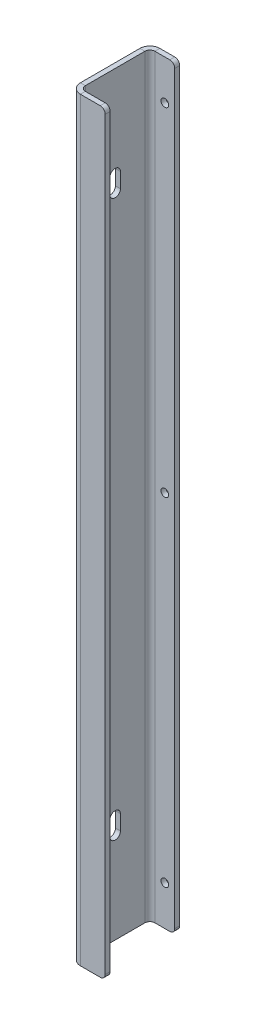
ISO-10303-21;
HEADER;
FILE_DESCRIPTION(('STEP AP214'),'2;1');
FILE_NAME('part.step','',(''),(''),'','','');
FILE_SCHEMA(('AUTOMOTIVE_DESIGN { 1 0 10303 214 1 1 1 1 }'));
ENDSEC;
DATA;
#1=APPLICATION_CONTEXT('core data for automotive mechanical design processes');
#2=APPLICATION_PROTOCOL_DEFINITION('international standard','automotive_design',2000,#1);
#3=PRODUCT_CONTEXT('',#1,'mechanical');
#4=PRODUCT('Part','Part','',(#3));
#5=PRODUCT_RELATED_PRODUCT_CATEGORY('part','',(#4));
#6=PRODUCT_DEFINITION_FORMATION('','',#4);
#7=PRODUCT_DEFINITION_CONTEXT('part definition',#1,'design');
#8=PRODUCT_DEFINITION('design','',#6,#7);
#9=PRODUCT_DEFINITION_SHAPE('','',#8);
#10=(LENGTH_UNIT() NAMED_UNIT(*) SI_UNIT(.MILLI.,.METRE.));
#11=(NAMED_UNIT(*) PLANE_ANGLE_UNIT() SI_UNIT($,.RADIAN.));
#12=(NAMED_UNIT(*) SI_UNIT($,.STERADIAN.) SOLID_ANGLE_UNIT());
#13=UNCERTAINTY_MEASURE_WITH_UNIT(LENGTH_MEASURE(1.E-05),#10,'distance_accuracy_value','');
#14=(GEOMETRIC_REPRESENTATION_CONTEXT(3) GLOBAL_UNCERTAINTY_ASSIGNED_CONTEXT((#13)) GLOBAL_UNIT_ASSIGNED_CONTEXT((#10,
#11,#12)) REPRESENTATION_CONTEXT('',''));
#15=CARTESIAN_POINT('',(0.,0.,0.));
#16=DIRECTION('',(0.,0.,1.));
#17=DIRECTION('',(1.,0.,0.));
#18=AXIS2_PLACEMENT_3D('',#15,#16,#17);
#19=CARTESIAN_POINT('',(-22.225,482.6,-6.35));
#20=DIRECTION('',(0.,1.,0.));
#21=DIRECTION('',(0.,0.,1.));
#22=AXIS2_PLACEMENT_3D('',#19,#20,#21);
#23=PLANE('',#22);
#24=DIRECTION('',(1.,0.,0.));
#25=VECTOR('',#24,1.);
#26=CARTESIAN_POINT('',(-22.225,482.6,-6.35));
#27=LINE('',#26,#25);
#28=CARTESIAN_POINT('',(-22.225,482.6,-6.35));
#29=VERTEX_POINT('',#28);
#30=CARTESIAN_POINT('',(-19.05,482.6,-6.35));
#31=VERTEX_POINT('',#30);
#32=EDGE_CURVE('E393',#29,#31,#27,.T.);
#33=ORIENTED_EDGE('',*,*,#32,.F.);
#34=CARTESIAN_POINT('',(-15.875,482.6,-6.35));
#35=DIRECTION('',(0.,1.,0.));
#36=DIRECTION('',(0.,0.,1.));
#37=AXIS2_PLACEMENT_3D('',#34,#35,#36);
#38=CIRCLE('',#37,6.35);
#39=CARTESIAN_POINT('',(-15.875,482.6,0.));
#40=VERTEX_POINT('',#39);
#41=EDGE_CURVE('E299',#40,#29,#38,.F.);
#42=ORIENTED_EDGE('',*,*,#41,.F.);
#43=DIRECTION('',(0.,0.,1.));
#44=VECTOR('',#43,1.);
#45=CARTESIAN_POINT('',(-15.875,482.6,-3.175));
#46=LINE('',#45,#44);
#47=CARTESIAN_POINT('',(-15.875,482.6,-3.175));
#48=VERTEX_POINT('',#47);
#49=EDGE_CURVE('E390',#48,#40,#46,.T.);
#50=ORIENTED_EDGE('',*,*,#49,.F.);
#51=CARTESIAN_POINT('',(-15.875,482.6,-6.35));
#52=DIRECTION('',(0.,1.,0.));
#53=DIRECTION('',(1.,0.,0.));
#54=AXIS2_PLACEMENT_3D('',#51,#52,#53);
#55=CIRCLE('',#54,3.175);
#56=EDGE_CURVE('E306',#48,#31,#55,.F.);
#57=ORIENTED_EDGE('',*,*,#56,.T.);
#58=EDGE_LOOP('',(#33,#42,#50,#57));
#59=FACE_BOUND('',#58,.T.);
#60=ADVANCED_FACE('F38',(#59),#23,.T.);
#61=CARTESIAN_POINT('',(-15.875,482.6,-3.175));
#62=DIRECTION('',(0.,1.,0.));
#63=DIRECTION('',(0.,0.,1.));
#64=AXIS2_PLACEMENT_3D('',#61,#62,#63);
#65=PLANE('',#64);
#66=DIRECTION('',(0.,0.,-1.));
#67=VECTOR('',#66,1.);
#68=CARTESIAN_POINT('',(-22.225,482.6,0.));
#69=LINE('',#68,#67);
#70=CARTESIAN_POINT('',(-22.225,482.6,-44.45));
#71=VERTEX_POINT('',#70);
#72=EDGE_CURVE('E296',#29,#71,#69,.T.);
#73=ORIENTED_EDGE('',*,*,#72,.F.);
#74=ORIENTED_EDGE('',*,*,#32,.T.);
#75=DIRECTION('',(0.,0.,-1.));
#76=VECTOR('',#75,1.);
#77=CARTESIAN_POINT('',(-19.05,482.6,0.));
#78=LINE('',#77,#76);
#79=CARTESIAN_POINT('',(-19.05,482.6,-44.45));
#80=VERTEX_POINT('',#79);
#81=EDGE_CURVE('E309',#31,#80,#78,.T.);
#82=ORIENTED_EDGE('',*,*,#81,.T.);
#83=DIRECTION('',(-1.,0.,0.));
#84=VECTOR('',#83,1.);
#85=CARTESIAN_POINT('',(-19.05,482.6,-44.45));
#86=LINE('',#85,#84);
#87=EDGE_CURVE('E381',#80,#71,#86,.T.);
#88=ORIENTED_EDGE('',*,*,#87,.T.);
#89=EDGE_LOOP('',(#73,#74,#82,#88));
#90=FACE_BOUND('',#89,.T.);
#91=ADVANCED_FACE('F484',(#90),#65,.T.);
#92=CARTESIAN_POINT('',(-15.875,0.,0.));
#93=DIRECTION('',(0.,-1.,0.));
#94=DIRECTION('',(0.,0.,-1.));
#95=AXIS2_PLACEMENT_3D('',#92,#93,#94);
#96=PLANE('',#95);
#97=DIRECTION('',(0.,0.,-1.));
#98=VECTOR('',#97,1.);
#99=CARTESIAN_POINT('',(-15.875,0.,0.));
#100=LINE('',#99,#98);
#101=CARTESIAN_POINT('',(-15.875,0.,0.));
#102=VERTEX_POINT('',#101);
#103=CARTESIAN_POINT('',(-15.875,0.,-3.175));
#104=VERTEX_POINT('',#103);
#105=EDGE_CURVE('E387',#102,#104,#100,.T.);
#106=ORIENTED_EDGE('',*,*,#105,.F.);
#107=CARTESIAN_POINT('',(-15.875,0.,-6.35));
#108=DIRECTION('',(0.,1.,0.));
#109=DIRECTION('',(0.,0.,1.));
#110=AXIS2_PLACEMENT_3D('',#107,#108,#109);
#111=CIRCLE('',#110,6.35);
#112=CARTESIAN_POINT('',(-22.225,0.,-6.35));
#113=VERTEX_POINT('',#112);
#114=EDGE_CURVE('E327',#102,#113,#111,.F.);
#115=ORIENTED_EDGE('',*,*,#114,.T.);
#116=DIRECTION('',(-1.,0.,0.));
#117=VECTOR('',#116,1.);
#118=CARTESIAN_POINT('',(-19.05,0.,-6.35));
#119=LINE('',#118,#117);
#120=CARTESIAN_POINT('',(-19.05,0.,-6.35));
#121=VERTEX_POINT('',#120);
#122=EDGE_CURVE('E385',#121,#113,#119,.T.);
#123=ORIENTED_EDGE('',*,*,#122,.F.);
#124=CARTESIAN_POINT('',(-15.875,0.,-6.35));
#125=DIRECTION('',(0.,1.,0.));
#126=DIRECTION('',(1.,0.,0.));
#127=AXIS2_PLACEMENT_3D('',#124,#125,#126);
#128=CIRCLE('',#127,3.175);
#129=EDGE_CURVE('E334',#104,#121,#128,.F.);
#130=ORIENTED_EDGE('',*,*,#129,.F.);
#131=EDGE_LOOP('',(#106,#115,#123,#130));
#132=FACE_BOUND('',#131,.T.);
#133=ADVANCED_FACE('F472',(#132),#96,.T.);
#134=CARTESIAN_POINT('',(-19.05,0.,-6.35));
#135=DIRECTION('',(0.,-1.,0.));
#136=DIRECTION('',(0.,0.,-1.));
#137=AXIS2_PLACEMENT_3D('',#134,#135,#136);
#138=PLANE('',#137);
#139=DIRECTION('',(-1.,0.,0.));
#140=VECTOR('',#139,1.);
#141=CARTESIAN_POINT('',(0.,0.,-3.175));
#142=LINE('',#141,#140);
#143=CARTESIAN_POINT('',(-3.175,0.,-3.175));
#144=VERTEX_POINT('',#143);
#145=EDGE_CURVE('E332',#144,#104,#142,.T.);
#146=ORIENTED_EDGE('',*,*,#145,.F.);
#147=DIRECTION('',(0.,0.,1.));
#148=VECTOR('',#147,1.);
#149=CARTESIAN_POINT('',(-3.175,0.,-6.35));
#150=LINE('',#149,#148);
#151=CARTESIAN_POINT('',(-3.175,0.,0.));
#152=VERTEX_POINT('',#151);
#153=EDGE_CURVE('E411',#144,#152,#150,.T.);
#154=ORIENTED_EDGE('',*,*,#153,.T.);
#155=DIRECTION('',(-1.,0.,0.));
#156=VECTOR('',#155,1.);
#157=CARTESIAN_POINT('',(0.,0.,0.));
#158=LINE('',#157,#156);
#159=EDGE_CURVE('E330',#152,#102,#158,.T.);
#160=ORIENTED_EDGE('',*,*,#159,.T.);
#161=ORIENTED_EDGE('',*,*,#105,.T.);
#162=EDGE_LOOP('',(#146,#154,#160,#161));
#163=FACE_BOUND('',#162,.T.);
#164=ADVANCED_FACE('F504',(#163),#138,.T.);
#165=CARTESIAN_POINT('',(-15.875,482.6,-50.8));
#166=DIRECTION('',(0.,1.,0.));
#167=DIRECTION('',(0.,0.,1.));
#168=AXIS2_PLACEMENT_3D('',#165,#166,#167);
#169=PLANE('',#168);
#170=DIRECTION('',(0.,0.,1.));
#171=VECTOR('',#170,1.);
#172=CARTESIAN_POINT('',(-15.875,482.6,-50.8));
#173=LINE('',#172,#171);
#174=CARTESIAN_POINT('',(-15.875,482.6,-50.8));
#175=VERTEX_POINT('',#174);
#176=CARTESIAN_POINT('',(-15.875,482.6,-47.625));
#177=VERTEX_POINT('',#176);
#178=EDGE_CURVE('E383',#175,#177,#173,.T.);
#179=ORIENTED_EDGE('',*,*,#178,.F.);
#180=CARTESIAN_POINT('',(-15.875,482.6,-44.45));
#181=DIRECTION('',(0.,1.,0.));
#182=DIRECTION('',(0.,0.,1.));
#183=AXIS2_PLACEMENT_3D('',#180,#181,#182);
#184=CIRCLE('',#183,6.35);
#185=EDGE_CURVE('E293',#71,#175,#184,.F.);
#186=ORIENTED_EDGE('',*,*,#185,.F.);
#187=ORIENTED_EDGE('',*,*,#87,.F.);
#188=CARTESIAN_POINT('',(-15.875,482.6,-44.45));
#189=DIRECTION('',(0.,1.,0.));
#190=DIRECTION('',(1.,0.,0.));
#191=AXIS2_PLACEMENT_3D('',#188,#189,#190);
#192=CIRCLE('',#191,3.175);
#193=EDGE_CURVE('E312',#80,#177,#192,.F.);
#194=ORIENTED_EDGE('',*,*,#193,.T.);
#195=EDGE_LOOP('',(#179,#186,#187,#194));
#196=FACE_BOUND('',#195,.T.);
#197=ADVANCED_FACE('F488',(#196),#169,.T.);
#198=CARTESIAN_POINT('',(-19.05,482.6,-44.45));
#199=DIRECTION('',(0.,1.,0.));
#200=DIRECTION('',(0.,0.,1.));
#201=AXIS2_PLACEMENT_3D('',#198,#199,#200);
#202=PLANE('',#201);
#203=DIRECTION('',(1.,0.,0.));
#204=VECTOR('',#203,1.);
#205=CARTESIAN_POINT('',(-22.225,482.6,-47.625));
#206=LINE('',#205,#204);
#207=CARTESIAN_POINT('',(-6.35,482.6,-47.625));
#208=VERTEX_POINT('',#207);
#209=EDGE_CURVE('E286',#177,#208,#206,.T.);
#210=ORIENTED_EDGE('',*,*,#209,.T.);
#211=DIRECTION('',(0.,0.,1.));
#212=VECTOR('',#211,1.);
#213=CARTESIAN_POINT('',(-6.35,482.6,-44.45));
#214=LINE('',#213,#212);
#215=CARTESIAN_POINT('',(-6.35,482.6,-50.8));
#216=VERTEX_POINT('',#215);
#217=EDGE_CURVE('E46',#208,#216,#214,.F.);
#218=ORIENTED_EDGE('',*,*,#217,.T.);
#219=DIRECTION('',(1.,0.,0.));
#220=VECTOR('',#219,1.);
#221=CARTESIAN_POINT('',(-22.225,482.6,-50.8));
#222=LINE('',#221,#220);
#223=EDGE_CURVE('E289',#175,#216,#222,.T.);
#224=ORIENTED_EDGE('',*,*,#223,.F.);
#225=ORIENTED_EDGE('',*,*,#178,.T.);
#226=EDGE_LOOP('',(#210,#218,#224,#225));
#227=FACE_BOUND('',#226,.T.);
#228=ADVANCED_FACE('F429',(#227),#202,.T.);
#229=CARTESIAN_POINT('',(-22.225,0.,-44.45));
#230=DIRECTION('',(0.,-1.,0.));
#231=DIRECTION('',(0.,0.,-1.));
#232=AXIS2_PLACEMENT_3D('',#229,#230,#231);
#233=PLANE('',#232);
#234=DIRECTION('',(1.,0.,0.));
#235=VECTOR('',#234,1.);
#236=CARTESIAN_POINT('',(-22.225,0.,-44.45));
#237=LINE('',#236,#235);
#238=CARTESIAN_POINT('',(-22.225,0.,-44.45));
#239=VERTEX_POINT('',#238);
#240=CARTESIAN_POINT('',(-19.05,0.,-44.45));
#241=VERTEX_POINT('',#240);
#242=EDGE_CURVE('E379',#239,#241,#237,.T.);
#243=ORIENTED_EDGE('',*,*,#242,.F.);
#244=CARTESIAN_POINT('',(-15.875,0.,-44.45));
#245=DIRECTION('',(0.,1.,0.));
#246=DIRECTION('',(0.,0.,1.));
#247=AXIS2_PLACEMENT_3D('',#244,#245,#246);
#248=CIRCLE('',#247,6.35);
#249=CARTESIAN_POINT('',(-15.875,0.,-50.8));
#250=VERTEX_POINT('',#249);
#251=EDGE_CURVE('E321',#239,#250,#248,.F.);
#252=ORIENTED_EDGE('',*,*,#251,.T.);
#253=DIRECTION('',(0.,0.,-1.));
#254=VECTOR('',#253,1.);
#255=CARTESIAN_POINT('',(-15.875,0.,-47.625));
#256=LINE('',#255,#254);
#257=CARTESIAN_POINT('',(-15.875,0.,-47.625));
#258=VERTEX_POINT('',#257);
#259=EDGE_CURVE('E377',#258,#250,#256,.T.);
#260=ORIENTED_EDGE('',*,*,#259,.F.);
#261=CARTESIAN_POINT('',(-15.875,0.,-44.45));
#262=DIRECTION('',(0.,1.,0.));
#263=DIRECTION('',(1.,0.,0.));
#264=AXIS2_PLACEMENT_3D('',#261,#262,#263);
#265=CIRCLE('',#264,3.175);
#266=EDGE_CURVE('E290',#241,#258,#265,.F.);
#267=ORIENTED_EDGE('',*,*,#266,.F.);
#268=EDGE_LOOP('',(#243,#252,#260,#267));
#269=FACE_BOUND('',#268,.T.);
#270=ADVANCED_FACE('F455',(#269),#233,.T.);
#271=CARTESIAN_POINT('',(-15.875,0.,-47.625));
#272=DIRECTION('',(0.,-1.,0.));
#273=DIRECTION('',(0.,0.,-1.));
#274=AXIS2_PLACEMENT_3D('',#271,#272,#273);
#275=PLANE('',#274);
#276=DIRECTION('',(0.,0.,-1.));
#277=VECTOR('',#276,1.);
#278=CARTESIAN_POINT('',(-22.225,0.,0.));
#279=LINE('',#278,#277);
#280=EDGE_CURVE('E324',#113,#239,#279,.T.);
#281=ORIENTED_EDGE('',*,*,#280,.T.);
#282=ORIENTED_EDGE('',*,*,#242,.T.);
#283=DIRECTION('',(0.,0.,-1.));
#284=VECTOR('',#283,1.);
#285=CARTESIAN_POINT('',(-19.05,0.,0.));
#286=LINE('',#285,#284);
#287=EDGE_CURVE('E337',#121,#241,#286,.T.);
#288=ORIENTED_EDGE('',*,*,#287,.F.);
#289=ORIENTED_EDGE('',*,*,#122,.T.);
#290=EDGE_LOOP('',(#281,#282,#288,#289));
#291=FACE_BOUND('',#290,.T.);
#292=ADVANCED_FACE('F463',(#291),#275,.T.);
#293=CARTESIAN_POINT('',(-22.225,482.6,-47.625));
#294=DIRECTION('',(0.,0.,-1.));
#295=DIRECTION('',(-1.,0.,0.));
#296=AXIS2_PLACEMENT_3D('',#293,#294,#295);
#297=PLANE('',#296);
#298=CARTESIAN_POINT('',(-9.525,457.2,-47.625));
#299=DIRECTION('',(0.,0.,-1.));
#300=DIRECTION('',(-1.,0.,0.));
#301=AXIS2_PLACEMENT_3D('',#298,#299,#300);
#302=CIRCLE('',#301,2.45745000000004);
#303=CARTESIAN_POINT('',(-11.98245,457.2,-47.625));
#304=VERTEX_POINT('',#303);
#305=EDGE_CURVE('E268',#304,#304,#302,.T.);
#306=ORIENTED_EDGE('',*,*,#305,.T.);
#307=EDGE_LOOP('',(#306));
#308=FACE_BOUND('',#307,.T.);
#309=CARTESIAN_POINT('',(-9.525,25.4,-47.625));
#310=DIRECTION('',(0.,0.,-1.));
#311=DIRECTION('',(-1.,0.,0.));
#312=AXIS2_PLACEMENT_3D('',#309,#310,#311);
#313=CIRCLE('',#312,2.45745);
#314=CARTESIAN_POINT('',(-11.98245,25.4,-47.625));
#315=VERTEX_POINT('',#314);
#316=EDGE_CURVE('E275',#315,#315,#313,.T.);
#317=ORIENTED_EDGE('',*,*,#316,.T.);
#318=EDGE_LOOP('',(#317));
#319=FACE_BOUND('',#318,.T.);
#320=CARTESIAN_POINT('',(-9.525,241.3,-47.625));
#321=DIRECTION('',(0.,0.,-1.));
#322=DIRECTION('',(-1.,0.,0.));
#323=AXIS2_PLACEMENT_3D('',#320,#321,#322);
#324=CIRCLE('',#323,2.45745);
#325=CARTESIAN_POINT('',(-11.98245,241.3,-47.625));
#326=VERTEX_POINT('',#325);
#327=EDGE_CURVE('E281',#326,#326,#324,.T.);
#328=ORIENTED_EDGE('',*,*,#327,.T.);
#329=EDGE_LOOP('',(#328));
#330=FACE_BOUND('',#329,.T.);
#331=DIRECTION('',(1.,0.,0.));
#332=VECTOR('',#331,1.);
#333=CARTESIAN_POINT('',(-22.225,0.,-47.625));
#334=LINE('',#333,#332);
#335=CARTESIAN_POINT('',(-6.35,0.,-47.625));
#336=VERTEX_POINT('',#335);
#337=EDGE_CURVE('E271',#258,#336,#334,.T.);
#338=ORIENTED_EDGE('',*,*,#337,.T.);
#339=CARTESIAN_POINT('',(-6.35,3.175,-47.625));
#340=DIRECTION('',(0.,0.,-1.));
#341=DIRECTION('',(-1.,0.,0.));
#342=AXIS2_PLACEMENT_3D('',#339,#340,#341);
#343=CIRCLE('',#342,3.175);
#344=CARTESIAN_POINT('',(-3.175,3.17500000000009,-47.625));
#345=VERTEX_POINT('',#344);
#346=EDGE_CURVE('E400',#336,#345,#343,.F.);
#347=ORIENTED_EDGE('',*,*,#346,.T.);
#348=DIRECTION('',(0.,-1.,0.));
#349=VECTOR('',#348,1.);
#350=CARTESIAN_POINT('',(-3.175,482.6,-47.625));
#351=LINE('',#350,#349);
#352=CARTESIAN_POINT('',(-3.175,479.425,-47.625));
#353=VERTEX_POINT('',#352);
#354=EDGE_CURVE('E374',#353,#345,#351,.T.);
#355=ORIENTED_EDGE('',*,*,#354,.F.);
#356=CARTESIAN_POINT('',(-6.35,479.425,-47.625));
#357=DIRECTION('',(0.,0.,-1.));
#358=DIRECTION('',(-1.,0.,0.));
#359=AXIS2_PLACEMENT_3D('',#356,#357,#358);
#360=CIRCLE('',#359,3.175);
#361=EDGE_CURVE('E398',#353,#208,#360,.F.);
#362=ORIENTED_EDGE('',*,*,#361,.T.);
#363=ORIENTED_EDGE('',*,*,#209,.F.);
#364=DIRECTION('',(0.,-1.,0.));
#365=VECTOR('',#364,1.);
#366=CARTESIAN_POINT('',(-15.875,482.6,-47.625));
#367=LINE('',#366,#365);
#368=EDGE_CURVE('E315',#177,#258,#367,.T.);
#369=ORIENTED_EDGE('',*,*,#368,.T.);
#370=EDGE_LOOP('',(#338,#347,#355,#362,#363,#369));
#371=FACE_BOUND('',#370,.T.);
#372=ADVANCED_FACE('F445',(#308,#319,#330,#371),#297,.F.);
#373=CARTESIAN_POINT('',(-3.175,482.6,-50.8));
#374=DIRECTION('',(1.,0.,0.));
#375=DIRECTION('',(0.,0.,-1.));
#376=AXIS2_PLACEMENT_3D('',#373,#374,#375);
#377=PLANE('',#376);
#378=ORIENTED_EDGE('',*,*,#354,.T.);
#379=DIRECTION('',(0.,0.,1.));
#380=VECTOR('',#379,1.);
#381=CARTESIAN_POINT('',(-3.175,3.175,-50.8));
#382=LINE('',#381,#380);
#383=CARTESIAN_POINT('',(-3.175,3.17500000000009,-50.8));
#384=VERTEX_POINT('',#383);
#385=EDGE_CURVE('E405',#345,#384,#382,.F.);
#386=ORIENTED_EDGE('',*,*,#385,.T.);
#387=DIRECTION('',(0.,-1.,0.));
#388=VECTOR('',#387,1.);
#389=CARTESIAN_POINT('',(-3.175,482.6,-50.8));
#390=LINE('',#389,#388);
#391=CARTESIAN_POINT('',(-3.175,479.425,-50.8));
#392=VERTEX_POINT('',#391);
#393=EDGE_CURVE('E371',#392,#384,#390,.T.);
#394=ORIENTED_EDGE('',*,*,#393,.F.);
#395=DIRECTION('',(0.,0.,1.));
#396=VECTOR('',#395,1.);
#397=CARTESIAN_POINT('',(-3.175,479.425,-50.8));
#398=LINE('',#397,#396);
#399=EDGE_CURVE('E402',#392,#353,#398,.T.);
#400=ORIENTED_EDGE('',*,*,#399,.T.);
#401=EDGE_LOOP('',(#378,#386,#394,#400));
#402=FACE_BOUND('',#401,.T.);
#403=ADVANCED_FACE('F442',(#402),#377,.T.);
#404=CARTESIAN_POINT('',(-22.225,482.6,-50.8));
#405=DIRECTION('',(0.,0.,-1.));
#406=DIRECTION('',(-1.,0.,0.));
#407=AXIS2_PLACEMENT_3D('',#404,#405,#406);
#408=PLANE('',#407);
#409=CARTESIAN_POINT('',(-9.525,457.2,-50.8));
#410=DIRECTION('',(0.,0.,-1.));
#411=DIRECTION('',(-1.,0.,0.));
#412=AXIS2_PLACEMENT_3D('',#409,#410,#411);
#413=CIRCLE('',#412,2.45745000000004);
#414=CARTESIAN_POINT('',(-11.98245,457.2,-50.8));
#415=VERTEX_POINT('',#414);
#416=EDGE_CURVE('E272',#415,#415,#413,.T.);
#417=ORIENTED_EDGE('',*,*,#416,.F.);
#418=EDGE_LOOP('',(#417));
#419=FACE_BOUND('',#418,.T.);
#420=CARTESIAN_POINT('',(-9.525,25.4,-50.8));
#421=DIRECTION('',(0.,0.,-1.));
#422=DIRECTION('',(-1.,0.,0.));
#423=AXIS2_PLACEMENT_3D('',#420,#421,#422);
#424=CIRCLE('',#423,2.45745);
#425=CARTESIAN_POINT('',(-11.98245,25.4,-50.8));
#426=VERTEX_POINT('',#425);
#427=EDGE_CURVE('E278',#426,#426,#424,.T.);
#428=ORIENTED_EDGE('',*,*,#427,.F.);
#429=EDGE_LOOP('',(#428));
#430=FACE_BOUND('',#429,.T.);
#431=CARTESIAN_POINT('',(-9.525,241.3,-50.8));
#432=DIRECTION('',(0.,0.,-1.));
#433=DIRECTION('',(-1.,0.,0.));
#434=AXIS2_PLACEMENT_3D('',#431,#432,#433);
#435=CIRCLE('',#434,2.45745);
#436=CARTESIAN_POINT('',(-11.98245,241.3,-50.8));
#437=VERTEX_POINT('',#436);
#438=EDGE_CURVE('E235',#437,#437,#435,.T.);
#439=ORIENTED_EDGE('',*,*,#438,.F.);
#440=EDGE_LOOP('',(#439));
#441=FACE_BOUND('',#440,.T.);
#442=ORIENTED_EDGE('',*,*,#393,.T.);
#443=CARTESIAN_POINT('',(-6.35,3.175,-50.8));
#444=DIRECTION('',(0.,0.,-1.));
#445=DIRECTION('',(-1.,0.,0.));
#446=AXIS2_PLACEMENT_3D('',#443,#444,#445);
#447=CIRCLE('',#446,3.175);
#448=CARTESIAN_POINT('',(-6.35,0.,-50.8));
#449=VERTEX_POINT('',#448);
#450=EDGE_CURVE('E409',#384,#449,#447,.T.);
#451=ORIENTED_EDGE('',*,*,#450,.T.);
#452=DIRECTION('',(1.,0.,0.));
#453=VECTOR('',#452,1.);
#454=CARTESIAN_POINT('',(-22.225,0.,-50.8));
#455=LINE('',#454,#453);
#456=EDGE_CURVE('E318',#250,#449,#455,.T.);
#457=ORIENTED_EDGE('',*,*,#456,.F.);
#458=DIRECTION('',(0.,-1.,0.));
#459=VECTOR('',#458,1.);
#460=CARTESIAN_POINT('',(-15.875,482.6,-50.8));
#461=LINE('',#460,#459);
#462=EDGE_CURVE('E368',#175,#250,#461,.T.);
#463=ORIENTED_EDGE('',*,*,#462,.F.);
#464=ORIENTED_EDGE('',*,*,#223,.T.);
#465=CARTESIAN_POINT('',(-6.35,479.425,-50.8));
#466=DIRECTION('',(0.,0.,-1.));
#467=DIRECTION('',(-1.,0.,0.));
#468=AXIS2_PLACEMENT_3D('',#465,#466,#467);
#469=CIRCLE('',#468,3.175);
#470=EDGE_CURVE('E407',#216,#392,#469,.T.);
#471=ORIENTED_EDGE('',*,*,#470,.T.);
#472=EDGE_LOOP('',(#442,#451,#457,#463,#464,#471));
#473=FACE_BOUND('',#472,.T.);
#474=ADVANCED_FACE('F435',(#419,#430,#441,#473),#408,.T.);
#475=CARTESIAN_POINT('',(-15.875,482.6,-44.45));
#476=DIRECTION('',(0.,-1.,0.));
#477=DIRECTION('',(0.,0.,-1.));
#478=AXIS2_PLACEMENT_3D('',#475,#476,#477);
#479=CYLINDRICAL_SURFACE('',#478,6.35);
#480=ORIENTED_EDGE('',*,*,#251,.F.);
#481=DIRECTION('',(0.,-1.,0.));
#482=VECTOR('',#481,1.);
#483=CARTESIAN_POINT('',(-22.225,482.6,-44.45));
#484=LINE('',#483,#482);
#485=EDGE_CURVE('E365',#71,#239,#484,.T.);
#486=ORIENTED_EDGE('',*,*,#485,.F.);
#487=ORIENTED_EDGE('',*,*,#185,.T.);
#488=ORIENTED_EDGE('',*,*,#462,.T.);
#489=EDGE_LOOP('',(#480,#486,#487,#488));
#490=FACE_BOUND('',#489,.T.);
#491=ADVANCED_FACE('F459',(#490),#479,.T.);
#492=CARTESIAN_POINT('',(-22.225,482.6,0.));
#493=DIRECTION('',(-1.,0.,0.));
#494=DIRECTION('',(0.,0.,1.));
#495=AXIS2_PLACEMENT_3D('',#492,#493,#494);
#496=PLANE('',#495);
#497=CARTESIAN_POINT('',(-22.225,423.8625,-25.4));
#498=DIRECTION('',(-1.,0.,0.));
#499=DIRECTION('',(0.,0.,1.));
#500=AXIS2_PLACEMENT_3D('',#497,#498,#499);
#501=CIRCLE('',#500,3.37343749999999);
#502=CARTESIAN_POINT('',(-22.225,423.8625,-22.0265625));
#503=VERTEX_POINT('',#502);
#504=CARTESIAN_POINT('',(-22.225,423.8625,-28.7734375));
#505=VERTEX_POINT('',#504);
#506=EDGE_CURVE('E53',#503,#505,#501,.T.);
#507=ORIENTED_EDGE('',*,*,#506,.F.);
#508=DIRECTION('',(0.,1.,0.));
#509=VECTOR('',#508,1.);
#510=CARTESIAN_POINT('',(-22.225,423.8625,-22.0265625));
#511=LINE('',#510,#509);
#512=CARTESIAN_POINT('',(-22.225,414.3375,-22.0265625));
#513=VERTEX_POINT('',#512);
#514=EDGE_CURVE('E219',#513,#503,#511,.T.);
#515=ORIENTED_EDGE('',*,*,#514,.F.);
#516=CARTESIAN_POINT('',(-22.225,414.3375,-25.4));
#517=DIRECTION('',(-1.,0.,0.));
#518=DIRECTION('',(0.,0.,1.));
#519=AXIS2_PLACEMENT_3D('',#516,#517,#518);
#520=CIRCLE('',#519,3.37343749999999);
#521=CARTESIAN_POINT('',(-22.225,414.3375,-28.7734375));
#522=VERTEX_POINT('',#521);
#523=EDGE_CURVE('E222',#522,#513,#520,.T.);
#524=ORIENTED_EDGE('',*,*,#523,.F.);
#525=DIRECTION('',(0.,-1.,0.));
#526=VECTOR('',#525,1.);
#527=CARTESIAN_POINT('',(-22.225,423.8625,-28.7734375));
#528=LINE('',#527,#526);
#529=EDGE_CURVE('E228',#505,#522,#528,.T.);
#530=ORIENTED_EDGE('',*,*,#529,.F.);
#531=EDGE_LOOP('',(#507,#515,#524,#530));
#532=FACE_BOUND('',#531,.T.);
#533=CARTESIAN_POINT('',(-22.225,58.7375,-25.4));
#534=DIRECTION('',(-1.,0.,0.));
#535=DIRECTION('',(0.,0.,1.));
#536=AXIS2_PLACEMENT_3D('',#533,#534,#535);
#537=CIRCLE('',#536,3.3734375);
#538=CARTESIAN_POINT('',(-22.225,58.7375,-28.7734375));
#539=VERTEX_POINT('',#538);
#540=CARTESIAN_POINT('',(-22.225,58.7375,-22.0265625));
#541=VERTEX_POINT('',#540);
#542=EDGE_CURVE('E61',#539,#541,#537,.T.);
#543=ORIENTED_EDGE('',*,*,#542,.F.);
#544=DIRECTION('',(0.,-1.,0.));
#545=VECTOR('',#544,1.);
#546=CARTESIAN_POINT('',(-22.225,58.7375,-28.7734375));
#547=LINE('',#546,#545);
#548=CARTESIAN_POINT('',(-22.225,68.2625,-28.7734375));
#549=VERTEX_POINT('',#548);
#550=EDGE_CURVE('E243',#549,#539,#547,.T.);
#551=ORIENTED_EDGE('',*,*,#550,.F.);
#552=CARTESIAN_POINT('',(-22.225,68.2625,-25.4));
#553=DIRECTION('',(-1.,0.,0.));
#554=DIRECTION('',(0.,0.,1.));
#555=AXIS2_PLACEMENT_3D('',#552,#553,#554);
#556=CIRCLE('',#555,3.3734375);
#557=CARTESIAN_POINT('',(-22.225,68.2625,-22.0265625));
#558=VERTEX_POINT('',#557);
#559=EDGE_CURVE('E257',#558,#549,#556,.T.);
#560=ORIENTED_EDGE('',*,*,#559,.F.);
#561=DIRECTION('',(0.,1.,0.));
#562=VECTOR('',#561,1.);
#563=CARTESIAN_POINT('',(-22.225,58.7375,-22.0265625));
#564=LINE('',#563,#562);
#565=EDGE_CURVE('E254',#541,#558,#564,.T.);
#566=ORIENTED_EDGE('',*,*,#565,.F.);
#567=EDGE_LOOP('',(#543,#551,#560,#566));
#568=FACE_BOUND('',#567,.T.);
#569=ORIENTED_EDGE('',*,*,#280,.F.);
#570=DIRECTION('',(0.,-1.,0.));
#571=VECTOR('',#570,1.);
#572=CARTESIAN_POINT('',(-22.225,482.6,-6.35));
#573=LINE('',#572,#571);
#574=EDGE_CURVE('E362',#29,#113,#573,.T.);
#575=ORIENTED_EDGE('',*,*,#574,.F.);
#576=ORIENTED_EDGE('',*,*,#72,.T.);
#577=ORIENTED_EDGE('',*,*,#485,.T.);
#578=EDGE_LOOP('',(#569,#575,#576,#577));
#579=FACE_BOUND('',#578,.T.);
#580=ADVANCED_FACE('F467',(#532,#568,#579),#496,.T.);
#581=CARTESIAN_POINT('',(-15.875,482.6,-6.35));
#582=DIRECTION('',(0.,-1.,0.));
#583=DIRECTION('',(0.,0.,-1.));
#584=AXIS2_PLACEMENT_3D('',#581,#582,#583);
#585=CYLINDRICAL_SURFACE('',#584,6.35);
#586=ORIENTED_EDGE('',*,*,#114,.F.);
#587=DIRECTION('',(0.,-1.,0.));
#588=VECTOR('',#587,1.);
#589=CARTESIAN_POINT('',(-15.875,482.6,0.));
#590=LINE('',#589,#588);
#591=EDGE_CURVE('E359',#40,#102,#590,.T.);
#592=ORIENTED_EDGE('',*,*,#591,.F.);
#593=ORIENTED_EDGE('',*,*,#41,.T.);
#594=ORIENTED_EDGE('',*,*,#574,.T.);
#595=EDGE_LOOP('',(#586,#592,#593,#594));
#596=FACE_BOUND('',#595,.T.);
#597=ADVANCED_FACE('F476',(#596),#585,.T.);
#598=CARTESIAN_POINT('',(0.,482.6,0.));
#599=DIRECTION('',(0.,0.,1.));
#600=DIRECTION('',(1.,0.,0.));
#601=AXIS2_PLACEMENT_3D('',#598,#599,#600);
#602=PLANE('',#601);
#603=ORIENTED_EDGE('',*,*,#159,.F.);
#604=CARTESIAN_POINT('',(-3.175,3.175,0.));
#605=DIRECTION('',(0.,0.,1.));
#606=DIRECTION('',(1.,0.,0.));
#607=AXIS2_PLACEMENT_3D('',#604,#605,#606);
#608=CIRCLE('',#607,3.175);
#609=CARTESIAN_POINT('',(0.,3.17500000000009,0.));
#610=VERTEX_POINT('',#609);
#611=EDGE_CURVE('E416',#152,#610,#608,.T.);
#612=ORIENTED_EDGE('',*,*,#611,.T.);
#613=DIRECTION('',(0.,-1.,0.));
#614=VECTOR('',#613,1.);
#615=CARTESIAN_POINT('',(0.,482.6,0.));
#616=LINE('',#615,#614);
#617=CARTESIAN_POINT('',(0.,479.425,0.));
#618=VERTEX_POINT('',#617);
#619=EDGE_CURVE('E356',#618,#610,#616,.T.);
#620=ORIENTED_EDGE('',*,*,#619,.F.);
#621=CARTESIAN_POINT('',(-3.175,479.425,0.));
#622=DIRECTION('',(0.,0.,1.));
#623=DIRECTION('',(1.,0.,0.));
#624=AXIS2_PLACEMENT_3D('',#621,#622,#623);
#625=CIRCLE('',#624,3.175);
#626=CARTESIAN_POINT('',(-3.175,482.6,0.));
#627=VERTEX_POINT('',#626);
#628=EDGE_CURVE('E414',#618,#627,#625,.T.);
#629=ORIENTED_EDGE('',*,*,#628,.T.);
#630=DIRECTION('',(-1.,0.,0.));
#631=VECTOR('',#630,1.);
#632=CARTESIAN_POINT('',(0.,482.6,0.));
#633=LINE('',#632,#631);
#634=EDGE_CURVE('E302',#627,#40,#633,.T.);
#635=ORIENTED_EDGE('',*,*,#634,.T.);
#636=ORIENTED_EDGE('',*,*,#591,.T.);
#637=EDGE_LOOP('',(#603,#612,#620,#629,#635,#636));
#638=FACE_BOUND('',#637,.T.);
#639=ADVANCED_FACE('F507',(#638),#602,.T.);
#640=CARTESIAN_POINT('',(0.,482.6,-3.175));
#641=DIRECTION('',(1.,0.,0.));
#642=DIRECTION('',(0.,0.,-1.));
#643=AXIS2_PLACEMENT_3D('',#640,#641,#642);
#644=PLANE('',#643);
#645=ORIENTED_EDGE('',*,*,#619,.T.);
#646=DIRECTION('',(0.,0.,1.));
#647=VECTOR('',#646,1.);
#648=CARTESIAN_POINT('',(0.,3.17499999999998,-3.175));
#649=LINE('',#648,#647);
#650=CARTESIAN_POINT('',(0.,3.17500000000009,-3.175));
#651=VERTEX_POINT('',#650);
#652=EDGE_CURVE('E421',#610,#651,#649,.F.);
#653=ORIENTED_EDGE('',*,*,#652,.T.);
#654=DIRECTION('',(0.,-1.,0.));
#655=VECTOR('',#654,1.);
#656=CARTESIAN_POINT('',(0.,482.6,-3.175));
#657=LINE('',#656,#655);
#658=CARTESIAN_POINT('',(0.,479.425,-3.175));
#659=VERTEX_POINT('',#658);
#660=EDGE_CURVE('E353',#659,#651,#657,.T.);
#661=ORIENTED_EDGE('',*,*,#660,.F.);
#662=DIRECTION('',(0.,0.,1.));
#663=VECTOR('',#662,1.);
#664=CARTESIAN_POINT('',(0.,479.425,-3.175));
#665=LINE('',#664,#663);
#666=EDGE_CURVE('E418',#659,#618,#665,.T.);
#667=ORIENTED_EDGE('',*,*,#666,.T.);
#668=EDGE_LOOP('',(#645,#653,#661,#667));
#669=FACE_BOUND('',#668,.T.);
#670=ADVANCED_FACE('F517',(#669),#644,.T.);
#671=CARTESIAN_POINT('',(0.,482.6,-3.175));
#672=DIRECTION('',(0.,0.,1.));
#673=DIRECTION('',(1.,0.,0.));
#674=AXIS2_PLACEMENT_3D('',#671,#672,#673);
#675=PLANE('',#674);
#676=ORIENTED_EDGE('',*,*,#660,.T.);
#677=CARTESIAN_POINT('',(-3.175,3.175,-3.175));
#678=DIRECTION('',(0.,0.,1.));
#679=DIRECTION('',(1.,0.,0.));
#680=AXIS2_PLACEMENT_3D('',#677,#678,#679);
#681=CIRCLE('',#680,3.175);
#682=EDGE_CURVE('E425',#651,#144,#681,.F.);
#683=ORIENTED_EDGE('',*,*,#682,.T.);
#684=ORIENTED_EDGE('',*,*,#145,.T.);
#685=DIRECTION('',(0.,-1.,0.));
#686=VECTOR('',#685,1.);
#687=CARTESIAN_POINT('',(-15.875,482.6,-3.175));
#688=LINE('',#687,#686);
#689=EDGE_CURVE('E350',#48,#104,#688,.T.);
#690=ORIENTED_EDGE('',*,*,#689,.F.);
#691=DIRECTION('',(-1.,0.,0.));
#692=VECTOR('',#691,1.);
#693=CARTESIAN_POINT('',(0.,482.6,-3.175));
#694=LINE('',#693,#692);
#695=CARTESIAN_POINT('',(-3.175,482.6,-3.175));
#696=VERTEX_POINT('',#695);
#697=EDGE_CURVE('E304',#696,#48,#694,.T.);
#698=ORIENTED_EDGE('',*,*,#697,.F.);
#699=CARTESIAN_POINT('',(-3.175,479.425,-3.175));
#700=DIRECTION('',(0.,0.,1.));
#701=DIRECTION('',(1.,0.,0.));
#702=AXIS2_PLACEMENT_3D('',#699,#700,#701);
#703=CIRCLE('',#702,3.175);
#704=EDGE_CURVE('E423',#696,#659,#703,.F.);
#705=ORIENTED_EDGE('',*,*,#704,.T.);
#706=EDGE_LOOP('',(#676,#683,#684,#690,#698,#705));
#707=FACE_BOUND('',#706,.T.);
#708=ADVANCED_FACE('F498',(#707),#675,.F.);
#709=CARTESIAN_POINT('',(-15.875,482.6,-6.35));
#710=DIRECTION('',(0.,-1.,0.));
#711=DIRECTION('',(0.,0.,-1.));
#712=AXIS2_PLACEMENT_3D('',#709,#710,#711);
#713=CYLINDRICAL_SURFACE('',#712,3.175);
#714=ORIENTED_EDGE('',*,*,#129,.T.);
#715=DIRECTION('',(0.,-1.,0.));
#716=VECTOR('',#715,1.);
#717=CARTESIAN_POINT('',(-19.05,482.6,-6.35));
#718=LINE('',#717,#716);
#719=EDGE_CURVE('E347',#31,#121,#718,.T.);
#720=ORIENTED_EDGE('',*,*,#719,.F.);
#721=ORIENTED_EDGE('',*,*,#56,.F.);
#722=ORIENTED_EDGE('',*,*,#689,.T.);
#723=EDGE_LOOP('',(#714,#720,#721,#722));
#724=FACE_BOUND('',#723,.T.);
#725=ADVANCED_FACE('F495',(#724),#713,.F.);
#726=CARTESIAN_POINT('',(-19.05,482.6,0.));
#727=DIRECTION('',(-1.,0.,0.));
#728=DIRECTION('',(0.,0.,1.));
#729=AXIS2_PLACEMENT_3D('',#726,#727,#728);
#730=PLANE('',#729);
#731=DIRECTION('',(0.,1.,0.));
#732=VECTOR('',#731,1.);
#733=CARTESIAN_POINT('',(-19.05,423.8625,-22.0265625));
#734=LINE('',#733,#732);
#735=CARTESIAN_POINT('',(-19.05,414.3375,-22.0265625));
#736=VERTEX_POINT('',#735);
#737=CARTESIAN_POINT('',(-19.05,423.8625,-22.0265625));
#738=VERTEX_POINT('',#737);
#739=EDGE_CURVE('E206',#736,#738,#734,.T.);
#740=ORIENTED_EDGE('',*,*,#739,.T.);
#741=CARTESIAN_POINT('',(-19.05,423.8625,-25.4));
#742=DIRECTION('',(-1.,0.,0.));
#743=DIRECTION('',(0.,0.,1.));
#744=AXIS2_PLACEMENT_3D('',#741,#742,#743);
#745=CIRCLE('',#744,3.37343749999999);
#746=CARTESIAN_POINT('',(-19.05,423.8625,-28.7734375));
#747=VERTEX_POINT('',#746);
#748=EDGE_CURVE('E200',#738,#747,#745,.T.);
#749=ORIENTED_EDGE('',*,*,#748,.T.);
#750=DIRECTION('',(0.,-1.,0.));
#751=VECTOR('',#750,1.);
#752=CARTESIAN_POINT('',(-19.05,423.8625,-28.7734375));
#753=LINE('',#752,#751);
#754=CARTESIAN_POINT('',(-19.05,414.3375,-28.7734375));
#755=VERTEX_POINT('',#754);
#756=EDGE_CURVE('E210',#747,#755,#753,.T.);
#757=ORIENTED_EDGE('',*,*,#756,.T.);
#758=CARTESIAN_POINT('',(-19.05,414.3375,-25.4));
#759=DIRECTION('',(-1.,0.,0.));
#760=DIRECTION('',(0.,0.,1.));
#761=AXIS2_PLACEMENT_3D('',#758,#759,#760);
#762=CIRCLE('',#761,3.37343749999999);
#763=EDGE_CURVE('E214',#755,#736,#762,.T.);
#764=ORIENTED_EDGE('',*,*,#763,.T.);
#765=EDGE_LOOP('',(#740,#749,#757,#764));
#766=FACE_BOUND('',#765,.T.);
#767=DIRECTION('',(0.,-1.,0.));
#768=VECTOR('',#767,1.);
#769=CARTESIAN_POINT('',(-19.05,58.7375,-28.7734375));
#770=LINE('',#769,#768);
#771=CARTESIAN_POINT('',(-19.05,68.2625,-28.7734375));
#772=VERTEX_POINT('',#771);
#773=CARTESIAN_POINT('',(-19.05,58.7375,-28.7734375));
#774=VERTEX_POINT('',#773);
#775=EDGE_CURVE('E249',#772,#774,#770,.T.);
#776=ORIENTED_EDGE('',*,*,#775,.T.);
#777=CARTESIAN_POINT('',(-19.05,58.7375,-25.4));
#778=DIRECTION('',(-1.,0.,0.));
#779=DIRECTION('',(0.,0.,1.));
#780=AXIS2_PLACEMENT_3D('',#777,#778,#779);
#781=CIRCLE('',#780,3.3734375);
#782=CARTESIAN_POINT('',(-19.05,58.7375,-22.0265625));
#783=VERTEX_POINT('',#782);
#784=EDGE_CURVE('E239',#774,#783,#781,.T.);
#785=ORIENTED_EDGE('',*,*,#784,.T.);
#786=DIRECTION('',(0.,1.,0.));
#787=VECTOR('',#786,1.);
#788=CARTESIAN_POINT('',(-19.05,58.7375,-22.0265625));
#789=LINE('',#788,#787);
#790=CARTESIAN_POINT('',(-19.05,68.2625,-22.0265625));
#791=VERTEX_POINT('',#790);
#792=EDGE_CURVE('E242',#783,#791,#789,.T.);
#793=ORIENTED_EDGE('',*,*,#792,.T.);
#794=CARTESIAN_POINT('',(-19.05,68.2625,-25.4));
#795=DIRECTION('',(-1.,0.,0.));
#796=DIRECTION('',(0.,0.,1.));
#797=AXIS2_PLACEMENT_3D('',#794,#795,#796);
#798=CIRCLE('',#797,3.3734375);
#799=EDGE_CURVE('E246',#791,#772,#798,.T.);
#800=ORIENTED_EDGE('',*,*,#799,.T.);
#801=EDGE_LOOP('',(#776,#785,#793,#800));
#802=FACE_BOUND('',#801,.T.);
#803=ORIENTED_EDGE('',*,*,#287,.T.);
#804=DIRECTION('',(0.,-1.,0.));
#805=VECTOR('',#804,1.);
#806=CARTESIAN_POINT('',(-19.05,482.6,-44.45));
#807=LINE('',#806,#805);
#808=EDGE_CURVE('E344',#80,#241,#807,.T.);
#809=ORIENTED_EDGE('',*,*,#808,.F.);
#810=ORIENTED_EDGE('',*,*,#81,.F.);
#811=ORIENTED_EDGE('',*,*,#719,.T.);
#812=EDGE_LOOP('',(#803,#809,#810,#811));
#813=FACE_BOUND('',#812,.T.);
#814=ADVANCED_FACE('F216',(#766,#802,#813),#730,.F.);
#815=CARTESIAN_POINT('',(-15.875,482.6,-44.45));
#816=DIRECTION('',(0.,-1.,0.));
#817=DIRECTION('',(0.,0.,-1.));
#818=AXIS2_PLACEMENT_3D('',#815,#816,#817);
#819=CYLINDRICAL_SURFACE('',#818,3.175);
#820=ORIENTED_EDGE('',*,*,#266,.T.);
#821=ORIENTED_EDGE('',*,*,#368,.F.);
#822=ORIENTED_EDGE('',*,*,#193,.F.);
#823=ORIENTED_EDGE('',*,*,#808,.T.);
#824=EDGE_LOOP('',(#820,#821,#822,#823));
#825=FACE_BOUND('',#824,.T.);
#826=ADVANCED_FACE('F492',(#825),#819,.F.);
#827=CARTESIAN_POINT('',(-15.875,482.6,-44.45));
#828=DIRECTION('',(0.,1.,0.));
#829=DIRECTION('',(1.,0.,0.));
#830=AXIS2_PLACEMENT_3D('',#827,#828,#829);
#831=PLANE('',#830);
#832=ORIENTED_EDGE('',*,*,#634,.F.);
#833=DIRECTION('',(0.,0.,1.));
#834=VECTOR('',#833,1.);
#835=CARTESIAN_POINT('',(-3.17500000000001,482.6,-44.45));
#836=LINE('',#835,#834);
#837=EDGE_CURVE('E11',#627,#696,#836,.F.);
#838=ORIENTED_EDGE('',*,*,#837,.T.);
#839=ORIENTED_EDGE('',*,*,#697,.T.);
#840=ORIENTED_EDGE('',*,*,#49,.T.);
#841=EDGE_LOOP('',(#832,#838,#839,#840));
#842=FACE_BOUND('',#841,.T.);
#843=ADVANCED_FACE('F512',(#842),#831,.T.);
#844=CARTESIAN_POINT('',(-15.875,0.,-44.45));
#845=DIRECTION('',(0.,1.,0.));
#846=DIRECTION('',(1.,0.,0.));
#847=AXIS2_PLACEMENT_3D('',#844,#845,#846);
#848=PLANE('',#847);
#849=ORIENTED_EDGE('',*,*,#456,.T.);
#850=DIRECTION('',(0.,0.,1.));
#851=VECTOR('',#850,1.);
#852=CARTESIAN_POINT('',(-6.35,0.,-47.625));
#853=LINE('',#852,#851);
#854=EDGE_CURVE('E395',#449,#336,#853,.T.);
#855=ORIENTED_EDGE('',*,*,#854,.T.);
#856=ORIENTED_EDGE('',*,*,#337,.F.);
#857=ORIENTED_EDGE('',*,*,#259,.T.);
#858=EDGE_LOOP('',(#849,#855,#856,#857));
#859=FACE_BOUND('',#858,.T.);
#860=ADVANCED_FACE('F452',(#859),#848,.F.);
#861=CARTESIAN_POINT('',(-9.525,241.3,-47.625));
#862=DIRECTION('',(0.,0.,-1.));
#863=DIRECTION('',(-1.,0.,0.));
#864=AXIS2_PLACEMENT_3D('',#861,#862,#863);
#865=CYLINDRICAL_SURFACE('',#864,2.45745);
#866=ORIENTED_EDGE('',*,*,#327,.F.);
#867=EDGE_LOOP('',(#866));
#868=FACE_BOUND('',#867,.T.);
#869=ORIENTED_EDGE('',*,*,#438,.T.);
#870=EDGE_LOOP('',(#869));
#871=FACE_BOUND('',#870,.T.);
#872=ADVANCED_FACE('F577',(#868,#871),#865,.F.);
#873=CARTESIAN_POINT('',(-9.525,25.4,-47.625));
#874=DIRECTION('',(0.,0.,-1.));
#875=DIRECTION('',(-1.,0.,0.));
#876=AXIS2_PLACEMENT_3D('',#873,#874,#875);
#877=CYLINDRICAL_SURFACE('',#876,2.45745);
#878=ORIENTED_EDGE('',*,*,#316,.F.);
#879=EDGE_LOOP('',(#878));
#880=FACE_BOUND('',#879,.T.);
#881=ORIENTED_EDGE('',*,*,#427,.T.);
#882=EDGE_LOOP('',(#881));
#883=FACE_BOUND('',#882,.T.);
#884=ADVANCED_FACE('F582',(#880,#883),#877,.F.);
#885=CARTESIAN_POINT('',(-9.525,457.2,-47.625));
#886=DIRECTION('',(0.,0.,-1.));
#887=DIRECTION('',(-1.,0.,0.));
#888=AXIS2_PLACEMENT_3D('',#885,#886,#887);
#889=CYLINDRICAL_SURFACE('',#888,2.45745000000004);
#890=ORIENTED_EDGE('',*,*,#305,.F.);
#891=EDGE_LOOP('',(#890));
#892=FACE_BOUND('',#891,.T.);
#893=ORIENTED_EDGE('',*,*,#416,.T.);
#894=EDGE_LOOP('',(#893));
#895=FACE_BOUND('',#894,.T.);
#896=ADVANCED_FACE('F527',(#892,#895),#889,.F.);
#897=CARTESIAN_POINT('',(-6.35,3.175,-44.45));
#898=DIRECTION('',(0.,0.,-1.));
#899=DIRECTION('',(-1.,0.,0.));
#900=AXIS2_PLACEMENT_3D('',#897,#898,#899);
#901=CYLINDRICAL_SURFACE('',#900,3.175);
#902=ORIENTED_EDGE('',*,*,#450,.F.);
#903=ORIENTED_EDGE('',*,*,#385,.F.);
#904=ORIENTED_EDGE('',*,*,#346,.F.);
#905=ORIENTED_EDGE('',*,*,#854,.F.);
#906=EDGE_LOOP('',(#902,#903,#904,#905));
#907=FACE_BOUND('',#906,.T.);
#908=ADVANCED_FACE('F450',(#907),#901,.T.);
#909=CARTESIAN_POINT('',(-3.175,3.175,-6.35));
#910=DIRECTION('',(0.,0.,1.));
#911=DIRECTION('',(1.,0.,0.));
#912=AXIS2_PLACEMENT_3D('',#909,#910,#911);
#913=CYLINDRICAL_SURFACE('',#912,3.175);
#914=ORIENTED_EDGE('',*,*,#682,.F.);
#915=ORIENTED_EDGE('',*,*,#652,.F.);
#916=ORIENTED_EDGE('',*,*,#611,.F.);
#917=ORIENTED_EDGE('',*,*,#153,.F.);
#918=EDGE_LOOP('',(#914,#915,#916,#917));
#919=FACE_BOUND('',#918,.T.);
#920=ADVANCED_FACE('F520',(#919),#913,.T.);
#921=CARTESIAN_POINT('',(-6.35,479.425,-50.8));
#922=DIRECTION('',(0.,0.,1.));
#923=DIRECTION('',(1.,0.,0.));
#924=AXIS2_PLACEMENT_3D('',#921,#922,#923);
#925=CYLINDRICAL_SURFACE('',#924,3.175);
#926=ORIENTED_EDGE('',*,*,#470,.F.);
#927=ORIENTED_EDGE('',*,*,#217,.F.);
#928=ORIENTED_EDGE('',*,*,#361,.F.);
#929=ORIENTED_EDGE('',*,*,#399,.F.);
#930=EDGE_LOOP('',(#926,#927,#928,#929));
#931=FACE_BOUND('',#930,.T.);
#932=ADVANCED_FACE('F439',(#931),#925,.T.);
#933=CARTESIAN_POINT('',(-3.175,479.425,-3.175));
#934=DIRECTION('',(0.,0.,1.));
#935=DIRECTION('',(1.,0.,0.));
#936=AXIS2_PLACEMENT_3D('',#933,#934,#935);
#937=CYLINDRICAL_SURFACE('',#936,3.175);
#938=ORIENTED_EDGE('',*,*,#704,.F.);
#939=ORIENTED_EDGE('',*,*,#837,.F.);
#940=ORIENTED_EDGE('',*,*,#628,.F.);
#941=ORIENTED_EDGE('',*,*,#666,.F.);
#942=EDGE_LOOP('',(#938,#939,#940,#941));
#943=FACE_BOUND('',#942,.T.);
#944=ADVANCED_FACE('F40',(#943),#937,.T.);
#945=CARTESIAN_POINT('',(-19.05,58.7375,-25.4));
#946=DIRECTION('',(-1.,0.,0.));
#947=DIRECTION('',(0.,0.,1.));
#948=AXIS2_PLACEMENT_3D('',#945,#946,#947);
#949=CYLINDRICAL_SURFACE('',#948,3.3734375);
#950=ORIENTED_EDGE('',*,*,#542,.T.);
#951=DIRECTION('',(-1.,0.,0.));
#952=VECTOR('',#951,1.);
#953=CARTESIAN_POINT('',(-19.05,58.7375,-22.0265625));
#954=LINE('',#953,#952);
#955=EDGE_CURVE('E252',#783,#541,#954,.T.);
#956=ORIENTED_EDGE('',*,*,#955,.F.);
#957=ORIENTED_EDGE('',*,*,#784,.F.);
#958=DIRECTION('',(-1.,0.,0.));
#959=VECTOR('',#958,1.);
#960=CARTESIAN_POINT('',(-19.05,58.7375,-28.7734375));
#961=LINE('',#960,#959);
#962=EDGE_CURVE('E229',#774,#539,#961,.T.);
#963=ORIENTED_EDGE('',*,*,#962,.T.);
#964=EDGE_LOOP('',(#950,#956,#957,#963));
#965=FACE_BOUND('',#964,.T.);
#966=ADVANCED_FACE('F590',(#965),#949,.F.);
#967=CARTESIAN_POINT('',(-19.05,58.7375,-28.7734375));
#968=DIRECTION('',(0.,0.,-1.));
#969=DIRECTION('',(0.,1.,0.));
#970=AXIS2_PLACEMENT_3D('',#967,#968,#969);
#971=PLANE('',#970);
#972=ORIENTED_EDGE('',*,*,#550,.T.);
#973=ORIENTED_EDGE('',*,*,#962,.F.);
#974=ORIENTED_EDGE('',*,*,#775,.F.);
#975=DIRECTION('',(-1.,0.,0.));
#976=VECTOR('',#975,1.);
#977=CARTESIAN_POINT('',(-19.05,68.2625,-28.7734375));
#978=LINE('',#977,#976);
#979=EDGE_CURVE('E263',#772,#549,#978,.T.);
#980=ORIENTED_EDGE('',*,*,#979,.T.);
#981=EDGE_LOOP('',(#972,#973,#974,#980));
#982=FACE_BOUND('',#981,.T.);
#983=ADVANCED_FACE('F593',(#982),#971,.F.);
#984=CARTESIAN_POINT('',(-19.05,68.2625,-25.4));
#985=DIRECTION('',(-1.,0.,0.));
#986=DIRECTION('',(0.,0.,1.));
#987=AXIS2_PLACEMENT_3D('',#984,#985,#986);
#988=CYLINDRICAL_SURFACE('',#987,3.3734375);
#989=ORIENTED_EDGE('',*,*,#559,.T.);
#990=ORIENTED_EDGE('',*,*,#979,.F.);
#991=ORIENTED_EDGE('',*,*,#799,.F.);
#992=DIRECTION('',(-1.,0.,0.));
#993=VECTOR('',#992,1.);
#994=CARTESIAN_POINT('',(-19.05,68.2625,-22.0265625));
#995=LINE('',#994,#993);
#996=EDGE_CURVE('E265',#791,#558,#995,.T.);
#997=ORIENTED_EDGE('',*,*,#996,.T.);
#998=EDGE_LOOP('',(#989,#990,#991,#997));
#999=FACE_BOUND('',#998,.T.);
#1000=ADVANCED_FACE('F597',(#999),#988,.F.);
#1001=CARTESIAN_POINT('',(-19.05,58.7375,-22.0265625));
#1002=DIRECTION('',(0.,0.,1.));
#1003=DIRECTION('',(0.,-1.,0.));
#1004=AXIS2_PLACEMENT_3D('',#1001,#1002,#1003);
#1005=PLANE('',#1004);
#1006=ORIENTED_EDGE('',*,*,#565,.T.);
#1007=ORIENTED_EDGE('',*,*,#996,.F.);
#1008=ORIENTED_EDGE('',*,*,#792,.F.);
#1009=ORIENTED_EDGE('',*,*,#955,.T.);
#1010=EDGE_LOOP('',(#1006,#1007,#1008,#1009));
#1011=FACE_BOUND('',#1010,.T.);
#1012=ADVANCED_FACE('F594',(#1011),#1005,.F.);
#1013=CARTESIAN_POINT('',(-19.05,423.8625,-25.4));
#1014=DIRECTION('',(-1.,0.,0.));
#1015=DIRECTION('',(0.,0.,1.));
#1016=AXIS2_PLACEMENT_3D('',#1013,#1014,#1015);
#1017=CYLINDRICAL_SURFACE('',#1016,3.37343749999999);
#1018=ORIENTED_EDGE('',*,*,#506,.T.);
#1019=DIRECTION('',(-1.,0.,0.));
#1020=VECTOR('',#1019,1.);
#1021=CARTESIAN_POINT('',(-19.05,423.8625,-28.7734375));
#1022=LINE('',#1021,#1020);
#1023=EDGE_CURVE('E196',#747,#505,#1022,.T.);
#1024=ORIENTED_EDGE('',*,*,#1023,.F.);
#1025=ORIENTED_EDGE('',*,*,#748,.F.);
#1026=DIRECTION('',(-1.,0.,0.));
#1027=VECTOR('',#1026,1.);
#1028=CARTESIAN_POINT('',(-19.05,423.8625,-22.0265625));
#1029=LINE('',#1028,#1027);
#1030=EDGE_CURVE('E233',#738,#503,#1029,.T.);
#1031=ORIENTED_EDGE('',*,*,#1030,.T.);
#1032=EDGE_LOOP('',(#1018,#1024,#1025,#1031));
#1033=FACE_BOUND('',#1032,.T.);
#1034=ADVANCED_FACE('F198',(#1033),#1017,.F.);
#1035=CARTESIAN_POINT('',(-19.05,423.8625,-22.0265625));
#1036=DIRECTION('',(0.,0.,1.));
#1037=DIRECTION('',(0.,-1.,0.));
#1038=AXIS2_PLACEMENT_3D('',#1035,#1036,#1037);
#1039=PLANE('',#1038);
#1040=ORIENTED_EDGE('',*,*,#514,.T.);
#1041=ORIENTED_EDGE('',*,*,#1030,.F.);
#1042=ORIENTED_EDGE('',*,*,#739,.F.);
#1043=DIRECTION('',(-1.,0.,0.));
#1044=VECTOR('',#1043,1.);
#1045=CARTESIAN_POINT('',(-19.05,414.3375,-22.0265625));
#1046=LINE('',#1045,#1044);
#1047=EDGE_CURVE('E236',#736,#513,#1046,.T.);
#1048=ORIENTED_EDGE('',*,*,#1047,.T.);
#1049=EDGE_LOOP('',(#1040,#1041,#1042,#1048));
#1050=FACE_BOUND('',#1049,.T.);
#1051=ADVANCED_FACE('F607',(#1050),#1039,.F.);
#1052=CARTESIAN_POINT('',(-19.05,414.3375,-25.4));
#1053=DIRECTION('',(-1.,0.,0.));
#1054=DIRECTION('',(0.,0.,1.));
#1055=AXIS2_PLACEMENT_3D('',#1052,#1053,#1054);
#1056=CYLINDRICAL_SURFACE('',#1055,3.37343749999999);
#1057=ORIENTED_EDGE('',*,*,#523,.T.);
#1058=ORIENTED_EDGE('',*,*,#1047,.F.);
#1059=ORIENTED_EDGE('',*,*,#763,.F.);
#1060=DIRECTION('',(-1.,0.,0.));
#1061=VECTOR('',#1060,1.);
#1062=CARTESIAN_POINT('',(-19.05,414.3375,-28.7734375));
#1063=LINE('',#1062,#1061);
#1064=EDGE_CURVE('E205',#755,#522,#1063,.T.);
#1065=ORIENTED_EDGE('',*,*,#1064,.T.);
#1066=EDGE_LOOP('',(#1057,#1058,#1059,#1065));
#1067=FACE_BOUND('',#1066,.T.);
#1068=ADVANCED_FACE('F610',(#1067),#1056,.F.);
#1069=CARTESIAN_POINT('',(-19.05,423.8625,-28.7734375));
#1070=DIRECTION('',(0.,0.,-1.));
#1071=DIRECTION('',(0.,1.,0.));
#1072=AXIS2_PLACEMENT_3D('',#1069,#1070,#1071);
#1073=PLANE('',#1072);
#1074=ORIENTED_EDGE('',*,*,#529,.T.);
#1075=ORIENTED_EDGE('',*,*,#1064,.F.);
#1076=ORIENTED_EDGE('',*,*,#756,.F.);
#1077=ORIENTED_EDGE('',*,*,#1023,.T.);
#1078=EDGE_LOOP('',(#1074,#1075,#1076,#1077));
#1079=FACE_BOUND('',#1078,.T.);
#1080=ADVANCED_FACE('F211',(#1079),#1073,.F.);
#1081=CLOSED_SHELL('',(#60,#91,#133,#164,#197,#228,#270,#292,#372,#403,#474,#491,#580,#597,#639,
#670,#708,#725,#814,#826,#843,#860,#872,#884,#896,#908,#920,#932,#944,#966,#983,#1000,#1012,
#1034,#1051,#1068,#1080));
#1082=MANIFOLD_SOLID_BREP('B2',#1081);
#1083=ADVANCED_BREP_SHAPE_REPRESENTATION('',(#18,#1082),#14);
#1084=SHAPE_DEFINITION_REPRESENTATION(#9,#1083);
ENDSEC;
END-ISO-10303-21;
